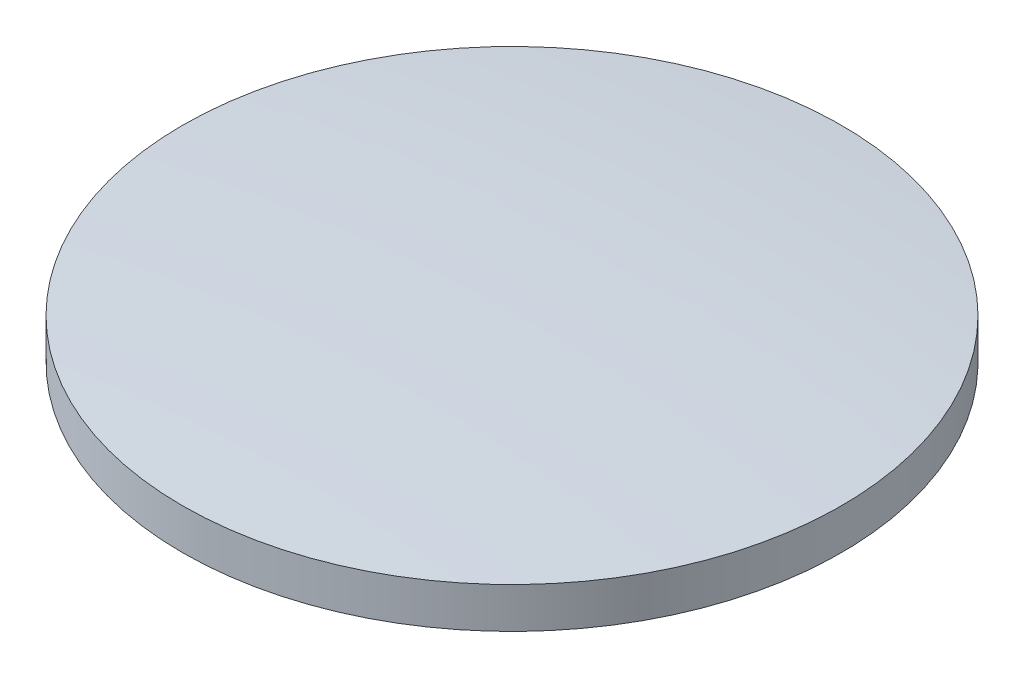
ISO-10303-21;
HEADER;
FILE_DESCRIPTION(('STEP AP214'),'2;1');
FILE_NAME('part.step','',(''),(''),'','','');
FILE_SCHEMA(('AUTOMOTIVE_DESIGN { 1 0 10303 214 1 1 1 1 }'));
ENDSEC;
DATA;
#1=APPLICATION_CONTEXT('core data for automotive mechanical design processes');
#2=APPLICATION_PROTOCOL_DEFINITION('international standard','automotive_design',2000,#1);
#3=PRODUCT_CONTEXT('',#1,'mechanical');
#4=PRODUCT('Part','Part','',(#3));
#5=PRODUCT_RELATED_PRODUCT_CATEGORY('part','',(#4));
#6=PRODUCT_DEFINITION_FORMATION('','',#4);
#7=PRODUCT_DEFINITION_CONTEXT('part definition',#1,'design');
#8=PRODUCT_DEFINITION('design','',#6,#7);
#9=PRODUCT_DEFINITION_SHAPE('','',#8);
#10=(LENGTH_UNIT() NAMED_UNIT(*) SI_UNIT(.MILLI.,.METRE.));
#11=(NAMED_UNIT(*) PLANE_ANGLE_UNIT() SI_UNIT($,.RADIAN.));
#12=(NAMED_UNIT(*) SI_UNIT($,.STERADIAN.) SOLID_ANGLE_UNIT());
#13=UNCERTAINTY_MEASURE_WITH_UNIT(LENGTH_MEASURE(1.E-05),#10,'distance_accuracy_value','');
#14=(GEOMETRIC_REPRESENTATION_CONTEXT(3) GLOBAL_UNCERTAINTY_ASSIGNED_CONTEXT((#13)) GLOBAL_UNIT_ASSIGNED_CONTEXT((#10,
#11,#12)) REPRESENTATION_CONTEXT('',''));
#15=CARTESIAN_POINT('',(0.,0.,0.));
#16=DIRECTION('',(0.,0.,1.));
#17=DIRECTION('',(1.,0.,0.));
#18=AXIS2_PLACEMENT_3D('',#15,#16,#17);
#19=CARTESIAN_POINT('',(0.,0.,0.));
#20=DIRECTION('',(0.,-1.,0.));
#21=DIRECTION('',(0.,0.,-1.));
#22=AXIS2_PLACEMENT_3D('',#19,#20,#21);
#23=PLANE('',#22);
#24=CARTESIAN_POINT('',(0.,0.,0.));
#25=DIRECTION('',(0.,1.,0.));
#26=DIRECTION('',(0.,0.,1.));
#27=AXIS2_PLACEMENT_3D('',#24,#25,#26);
#28=CIRCLE('',#27,25.95);
#29=CARTESIAN_POINT('',(0.,0.,25.95));
#30=VERTEX_POINT('',#29);
#31=EDGE_CURVE('E36',#30,#30,#28,.T.);
#32=ORIENTED_EDGE('',*,*,#31,.F.);
#33=EDGE_LOOP('',(#32));
#34=FACE_BOUND('',#33,.T.);
#35=ADVANCED_FACE('F30',(#34),#23,.T.);
#36=CARTESIAN_POINT('',(0.,-276.784375000001,0.));
#37=DIRECTION('',(0.,1.,0.));
#38=DIRECTION('',(-1.,0.,0.));
#39=AXIS2_PLACEMENT_3D('',#36,#37,#38);
#40=SPHERICAL_SURFACE('',#39,281.184375000001);
#41=CARTESIAN_POINT('',(0.,3.2,0.));
#42=DIRECTION('',(0.,1.,0.));
#43=DIRECTION('',(0.,0.,1.));
#44=AXIS2_PLACEMENT_3D('',#41,#42,#43);
#45=CIRCLE('',#44,25.95);
#46=CARTESIAN_POINT('',(0.,3.2,25.95));
#47=VERTEX_POINT('',#46);
#48=EDGE_CURVE('E10',#47,#47,#45,.T.);
#49=ORIENTED_EDGE('',*,*,#48,.T.);
#50=EDGE_LOOP('',(#49));
#51=FACE_BOUND('',#50,.T.);
#52=ADVANCED_FACE('F46',(#51),#40,.T.);
#53=CARTESIAN_POINT('',(0.,3.2,0.));
#54=DIRECTION('',(0.,1.,0.));
#55=DIRECTION('',(0.,0.,1.));
#56=AXIS2_PLACEMENT_3D('',#53,#54,#55);
#57=CYLINDRICAL_SURFACE('',#56,25.95);
#58=ORIENTED_EDGE('',*,*,#31,.T.);
#59=EDGE_LOOP('',(#58));
#60=FACE_BOUND('',#59,.T.);
#61=ORIENTED_EDGE('',*,*,#48,.F.);
#62=EDGE_LOOP('',(#61));
#63=FACE_BOUND('',#62,.T.);
#64=ADVANCED_FACE('F42',(#60,#63),#57,.T.);
#65=CLOSED_SHELL('',(#35,#52,#64));
#66=MANIFOLD_SOLID_BREP('B2',#65);
#67=ADVANCED_BREP_SHAPE_REPRESENTATION('',(#18,#66),#14);
#68=SHAPE_DEFINITION_REPRESENTATION(#9,#67);
ENDSEC;
END-ISO-10303-21;
